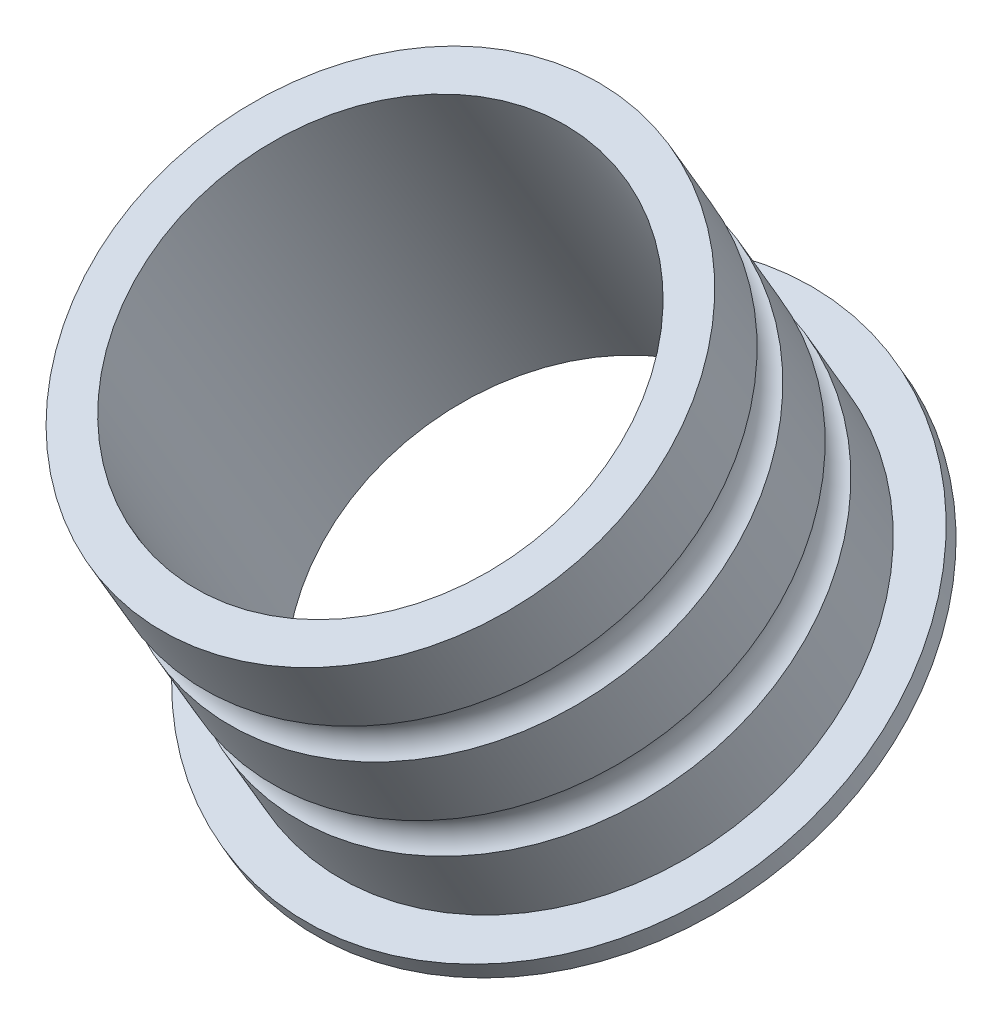
ISO-10303-21;
HEADER;
FILE_DESCRIPTION(('STEP AP214'),'2;1');
FILE_NAME('part.step','',(''),(''),'','','');
FILE_SCHEMA(('AUTOMOTIVE_DESIGN { 1 0 10303 214 1 1 1 1 }'));
ENDSEC;
DATA;
#1=APPLICATION_CONTEXT('core data for automotive mechanical design processes');
#2=APPLICATION_PROTOCOL_DEFINITION('international standard','automotive_design',2000,#1);
#3=PRODUCT_CONTEXT('',#1,'mechanical');
#4=PRODUCT('Part','Part','',(#3));
#5=PRODUCT_RELATED_PRODUCT_CATEGORY('part','',(#4));
#6=PRODUCT_DEFINITION_FORMATION('','',#4);
#7=PRODUCT_DEFINITION_CONTEXT('part definition',#1,'design');
#8=PRODUCT_DEFINITION('design','',#6,#7);
#9=PRODUCT_DEFINITION_SHAPE('','',#8);
#10=(LENGTH_UNIT() NAMED_UNIT(*) SI_UNIT(.MILLI.,.METRE.));
#11=(NAMED_UNIT(*) PLANE_ANGLE_UNIT() SI_UNIT($,.RADIAN.));
#12=(NAMED_UNIT(*) SI_UNIT($,.STERADIAN.) SOLID_ANGLE_UNIT());
#13=UNCERTAINTY_MEASURE_WITH_UNIT(LENGTH_MEASURE(1.E-05),#10,'distance_accuracy_value','');
#14=(GEOMETRIC_REPRESENTATION_CONTEXT(3) GLOBAL_UNCERTAINTY_ASSIGNED_CONTEXT((#13)) GLOBAL_UNIT_ASSIGNED_CONTEXT((#10,
#11,#12)) REPRESENTATION_CONTEXT('',''));
#15=CARTESIAN_POINT('',(0.,0.,0.));
#16=DIRECTION('',(0.,0.,1.));
#17=DIRECTION('',(1.,0.,0.));
#18=AXIS2_PLACEMENT_3D('',#15,#16,#17);
#19=CARTESIAN_POINT('',(0.,56.2750814402053,18.0760250071093));
#20=DIRECTION('',(0.,0.861954035177848,0.506986431022198));
#21=DIRECTION('',(0.,-0.506986431022198,0.861954035177848));
#22=AXIS2_PLACEMENT_3D('',#19,#20,#21);
#23=PLANE('',#22);
#24=CARTESIAN_POINT('',(0.,49.709607158468,29.2383297626622));
#25=DIRECTION('',(0.,-0.861954035177848,-0.506986431022198));
#26=DIRECTION('',(0.,0.506986431022198,-0.861954035177848));
#27=AXIS2_PLACEMENT_3D('',#24,#25,#26);
#28=CIRCLE('',#27,10.9499999999997);
#29=CARTESIAN_POINT('',(0.,55.2611085781609,19.799933077465));
#30=VERTEX_POINT('',#29);
#31=EDGE_CURVE('E10',#30,#30,#28,.T.);
#32=ORIENTED_EDGE('',*,*,#31,.T.);
#33=EDGE_LOOP('',(#32));
#34=FACE_BOUND('',#33,.T.);
#35=CARTESIAN_POINT('',(0.,49.709607158468,29.2383297626622));
#36=DIRECTION('',(0.,-0.861954035177848,-0.506986431022198));
#37=DIRECTION('',(0.,0.506986431022198,-0.861954035177848));
#38=AXIS2_PLACEMENT_3D('',#35,#36,#37);
#39=CIRCLE('',#38,12.9499999999997);
#40=CARTESIAN_POINT('',(0.,56.2750814402053,18.0760250071093));
#41=VERTEX_POINT('',#40);
#42=EDGE_CURVE('E62',#41,#41,#39,.T.);
#43=ORIENTED_EDGE('',*,*,#42,.F.);
#44=EDGE_LOOP('',(#43));
#45=FACE_BOUND('',#44,.T.);
#46=ADVANCED_FACE('F31',(#34,#45),#23,.T.);
#47=CARTESIAN_POINT('',(0.,0.,0.));
#48=DIRECTION('',(0.,-0.861954035177848,-0.506986431022198));
#49=DIRECTION('',(0.,0.506986431022198,-0.861954035177848));
#50=AXIS2_PLACEMENT_3D('',#47,#48,#49);
#51=CYLINDRICAL_SURFACE('',#50,10.9499999999997);
#52=ORIENTED_EDGE('',*,*,#31,.F.);
#53=EDGE_LOOP('',(#52));
#54=FACE_BOUND('',#53,.T.);
#55=CARTESIAN_POINT('',(0.,33.3324804900889,19.6055875732404));
#56=DIRECTION('',(0.,-0.861954035177848,-0.506986431022198));
#57=DIRECTION('',(0.,0.506986431022198,-0.861954035177848));
#58=AXIS2_PLACEMENT_3D('',#55,#56,#57);
#59=CIRCLE('',#58,10.95);
#60=CARTESIAN_POINT('',(0.,38.883981909782,10.167190888043));
#61=VERTEX_POINT('',#60);
#62=EDGE_CURVE('E34',#61,#61,#59,.T.);
#63=ORIENTED_EDGE('',*,*,#62,.T.);
#64=EDGE_LOOP('',(#63));
#65=FACE_BOUND('',#64,.T.);
#66=ADVANCED_FACE('F69',(#54,#65),#51,.F.);
#67=CARTESIAN_POINT('',(0.,36.8813855072443,13.5719093269955));
#68=DIRECTION('',(0.,-0.861954035177848,-0.506986431022198));
#69=DIRECTION('',(0.,0.506986431022198,-0.861954035177848));
#70=AXIS2_PLACEMENT_3D('',#67,#68,#69);
#71=PLANE('',#70);
#72=ORIENTED_EDGE('',*,*,#62,.F.);
#73=EDGE_LOOP('',(#72));
#74=FACE_BOUND('',#73,.T.);
#75=CARTESIAN_POINT('',(0.,33.3324804900889,19.6055875732404));
#76=DIRECTION('',(0.,-0.861954035177848,-0.506986431022198));
#77=DIRECTION('',(0.,0.506986431022198,-0.861954035177848));
#78=AXIS2_PLACEMENT_3D('',#75,#76,#77);
#79=CIRCLE('',#78,14.9999999999998);
#80=CARTESIAN_POINT('',(0.,40.9372769554218,6.67627704557286));
#81=VERTEX_POINT('',#80);
#82=EDGE_CURVE('E38',#81,#81,#79,.T.);
#83=ORIENTED_EDGE('',*,*,#82,.T.);
#84=EDGE_LOOP('',(#83));
#85=FACE_BOUND('',#84,.T.);
#86=ADVANCED_FACE('F71',(#74,#85),#71,.T.);
#87=CARTESIAN_POINT('',(0.,0.,0.));
#88=DIRECTION('',(0.,-0.861954035177848,-0.506986431022198));
#89=DIRECTION('',(0.,0.506986431022198,-0.861954035177848));
#90=AXIS2_PLACEMENT_3D('',#87,#88,#89);
#91=CYLINDRICAL_SURFACE('',#90,14.9999999999998);
#92=CARTESIAN_POINT('',(0.,34.1944345252668,20.1125740042626));
#93=DIRECTION('',(0.,-0.861954035177848,-0.506986431022198));
#94=DIRECTION('',(0.,0.506986431022198,-0.861954035177848));
#95=AXIS2_PLACEMENT_3D('',#92,#93,#94);
#96=CIRCLE('',#95,14.9999999999998);
#97=CARTESIAN_POINT('',(0.,41.7992309905996,7.18326347659504));
#98=VERTEX_POINT('',#97);
#99=EDGE_CURVE('E42',#98,#98,#96,.T.);
#100=ORIENTED_EDGE('',*,*,#99,.T.);
#101=EDGE_LOOP('',(#100));
#102=FACE_BOUND('',#101,.T.);
#103=ORIENTED_EDGE('',*,*,#82,.F.);
#104=EDGE_LOOP('',(#103));
#105=FACE_BOUND('',#104,.T.);
#106=ADVANCED_FACE('F74',(#102,#105),#91,.T.);
#107=CARTESIAN_POINT('',(0.,41.7992309905996,7.18326347659503));
#108=DIRECTION('',(0.,0.861954035177848,0.506986431022198));
#109=DIRECTION('',(0.,-0.506986431022198,0.861954035177848));
#110=AXIS2_PLACEMENT_3D('',#107,#108,#109);
#111=PLANE('',#110);
#112=CARTESIAN_POINT('',(0.,34.1944345252667,20.1125740042626));
#113=DIRECTION('',(0.,-0.861954035177848,-0.506986431022198));
#114=DIRECTION('',(0.,0.506986431022198,-0.861954035177848));
#115=AXIS2_PLACEMENT_3D('',#112,#113,#114);
#116=CIRCLE('',#115,12.9499999999997);
#117=CARTESIAN_POINT('',(0.,40.759908807004,8.95026924870976));
#118=VERTEX_POINT('',#117);
#119=EDGE_CURVE('E47',#118,#118,#116,.T.);
#120=ORIENTED_EDGE('',*,*,#119,.T.);
#121=EDGE_LOOP('',(#120));
#122=FACE_BOUND('',#121,.T.);
#123=ORIENTED_EDGE('',*,*,#99,.F.);
#124=EDGE_LOOP('',(#123));
#125=FACE_BOUND('',#124,.T.);
#126=ADVANCED_FACE('F79',(#122,#125),#111,.T.);
#127=CARTESIAN_POINT('',(0.,0.,0.));
#128=DIRECTION('',(0.,-0.861954035177848,-0.506986431022198));
#129=DIRECTION('',(0.,0.506986431022198,-0.861954035177848));
#130=AXIS2_PLACEMENT_3D('',#127,#128,#129);
#131=CYLINDRICAL_SURFACE('',#130,12.9499999999997);
#132=CARTESIAN_POINT('',(0.,37.8732105536168,22.2763663331173));
#133=DIRECTION('',(0.,-0.861954035177848,-0.506986431022198));
#134=DIRECTION('',(0.,0.506986431022198,-0.861954035177848));
#135=AXIS2_PLACEMENT_3D('',#132,#133,#134);
#136=CIRCLE('',#135,12.9499999999997);
#137=CARTESIAN_POINT('',(0.,44.4386848353541,11.1140615775645));
#138=VERTEX_POINT('',#137);
#139=EDGE_CURVE('E50',#138,#138,#136,.T.);
#140=ORIENTED_EDGE('',*,*,#139,.T.);
#141=EDGE_LOOP('',(#140));
#142=FACE_BOUND('',#141,.T.);
#143=ORIENTED_EDGE('',*,*,#119,.F.);
#144=EDGE_LOOP('',(#143));
#145=FACE_BOUND('',#144,.T.);
#146=ADVANCED_FACE('F85',(#142,#145),#131,.T.);
#147=CARTESIAN_POINT('',(0.,38.9929216906546,22.9349610260762));
#148=DIRECTION('',(0.,-0.861954035177848,-0.506986431022198));
#149=DIRECTION('',(0.,0.506986431022198,-0.861954035177848));
#150=AXIS2_PLACEMENT_3D('',#147,#148,#149);
#151=TOROIDAL_SURFACE('',#150,13.6999999999997,1.49999999999999);
#152=CARTESIAN_POINT('',(0.,40.1126328276924,23.593555719035));
#153=DIRECTION('',(0.,-0.861954035177848,-0.506986431022198));
#154=DIRECTION('',(0.,0.506986431022198,-0.861954035177848));
#155=AXIS2_PLACEMENT_3D('',#152,#153,#154);
#156=CIRCLE('',#155,12.9499999999998);
#157=CARTESIAN_POINT('',(0.,46.6781071094297,12.4312509634821));
#158=VERTEX_POINT('',#157);
#159=EDGE_CURVE('E53',#158,#158,#156,.T.);
#160=ORIENTED_EDGE('',*,*,#159,.T.);
#161=EDGE_LOOP('',(#160));
#162=FACE_BOUND('',#161,.T.);
#163=ORIENTED_EDGE('',*,*,#139,.F.);
#164=EDGE_LOOP('',(#163));
#165=FACE_BOUND('',#164,.T.);
#166=ADVANCED_FACE('F124',(#162,#165),#151,.F.);
#167=CARTESIAN_POINT('',(0.,0.,0.));
#168=DIRECTION('',(0.,-0.861954035177848,-0.506986431022198));
#169=DIRECTION('',(0.,0.506986431022198,-0.861954035177848));
#170=AXIS2_PLACEMENT_3D('',#167,#168,#169);
#171=CYLINDRICAL_SURFACE('',#170,12.9499999999998);
#172=CARTESIAN_POINT('',(0.,43.7914088560424,25.7573480478898));
#173=DIRECTION('',(0.,-0.861954035177848,-0.506986431022198));
#174=DIRECTION('',(0.,0.506986431022198,-0.861954035177848));
#175=AXIS2_PLACEMENT_3D('',#172,#173,#174);
#176=CIRCLE('',#175,12.9499999999997);
#177=CARTESIAN_POINT('',(0.,50.3568831377798,14.5950432923369));
#178=VERTEX_POINT('',#177);
#179=EDGE_CURVE('E56',#178,#178,#176,.T.);
#180=ORIENTED_EDGE('',*,*,#179,.T.);
#181=EDGE_LOOP('',(#180));
#182=FACE_BOUND('',#181,.T.);
#183=ORIENTED_EDGE('',*,*,#159,.F.);
#184=EDGE_LOOP('',(#183));
#185=FACE_BOUND('',#184,.T.);
#186=ADVANCED_FACE('F133',(#182,#185),#171,.T.);
#187=CARTESIAN_POINT('',(0.,44.9111199930802,26.4159427408486));
#188=DIRECTION('',(0.,-0.861954035177848,-0.506986431022198));
#189=DIRECTION('',(0.,0.506986431022198,-0.861954035177848));
#190=AXIS2_PLACEMENT_3D('',#187,#188,#189);
#191=TOROIDAL_SURFACE('',#190,13.6999999999998,1.49999999999999);
#192=CARTESIAN_POINT('',(0.,46.0308311301179,27.0745374338074));
#193=DIRECTION('',(0.,-0.861954035177848,-0.506986431022198));
#194=DIRECTION('',(0.,0.506986431022198,-0.861954035177848));
#195=AXIS2_PLACEMENT_3D('',#192,#193,#194);
#196=CIRCLE('',#195,12.9499999999998);
#197=CARTESIAN_POINT('',(0.,52.5963054118553,15.9122326782545));
#198=VERTEX_POINT('',#197);
#199=EDGE_CURVE('E59',#198,#198,#196,.T.);
#200=ORIENTED_EDGE('',*,*,#199,.T.);
#201=EDGE_LOOP('',(#200));
#202=FACE_BOUND('',#201,.T.);
#203=ORIENTED_EDGE('',*,*,#179,.F.);
#204=EDGE_LOOP('',(#203));
#205=FACE_BOUND('',#204,.T.);
#206=ADVANCED_FACE('F142',(#202,#205),#191,.F.);
#207=CARTESIAN_POINT('',(0.,0.,0.));
#208=DIRECTION('',(0.,-0.861954035177848,-0.506986431022198));
#209=DIRECTION('',(0.,0.506986431022198,-0.861954035177848));
#210=AXIS2_PLACEMENT_3D('',#207,#208,#209);
#211=CYLINDRICAL_SURFACE('',#210,12.9499999999998);
#212=ORIENTED_EDGE('',*,*,#42,.T.);
#213=EDGE_LOOP('',(#212));
#214=FACE_BOUND('',#213,.T.);
#215=ORIENTED_EDGE('',*,*,#199,.F.);
#216=EDGE_LOOP('',(#215));
#217=FACE_BOUND('',#216,.T.);
#218=ADVANCED_FACE('F151',(#214,#217),#211,.T.);
#219=CLOSED_SHELL('',(#46,#66,#86,#106,#126,#146,#166,#186,#206,#218));
#220=MANIFOLD_SOLID_BREP('B2',#219);
#221=ADVANCED_BREP_SHAPE_REPRESENTATION('',(#18,#220),#14);
#222=SHAPE_DEFINITION_REPRESENTATION(#9,#221);
ENDSEC;
END-ISO-10303-21;
